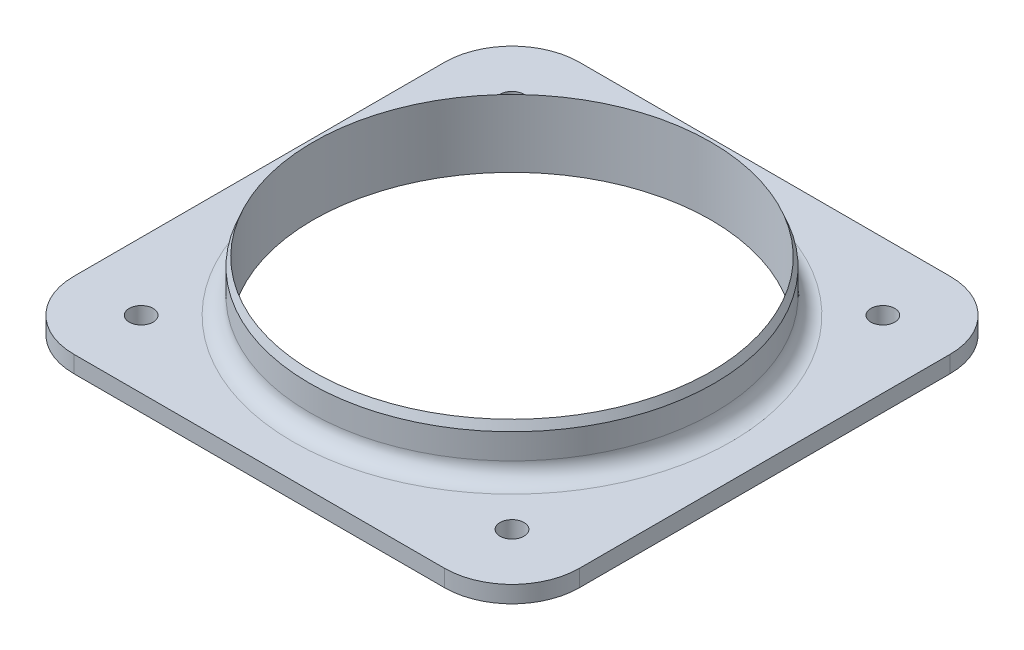
ISO-10303-21;
HEADER;
FILE_DESCRIPTION(('STEP AP214'),'2;1');
FILE_NAME('part.step','',(''),(''),'','','');
FILE_SCHEMA(('AUTOMOTIVE_DESIGN { 1 0 10303 214 1 1 1 1 }'));
ENDSEC;
DATA;
#1=APPLICATION_CONTEXT('core data for automotive mechanical design processes');
#2=APPLICATION_PROTOCOL_DEFINITION('international standard','automotive_design',2000,#1);
#3=PRODUCT_CONTEXT('',#1,'mechanical');
#4=PRODUCT('Part','Part','',(#3));
#5=PRODUCT_RELATED_PRODUCT_CATEGORY('part','',(#4));
#6=PRODUCT_DEFINITION_FORMATION('','',#4);
#7=PRODUCT_DEFINITION_CONTEXT('part definition',#1,'design');
#8=PRODUCT_DEFINITION('design','',#6,#7);
#9=PRODUCT_DEFINITION_SHAPE('','',#8);
#10=(LENGTH_UNIT() NAMED_UNIT(*) SI_UNIT(.MILLI.,.METRE.));
#11=(NAMED_UNIT(*) PLANE_ANGLE_UNIT() SI_UNIT($,.RADIAN.));
#12=(NAMED_UNIT(*) SI_UNIT($,.STERADIAN.) SOLID_ANGLE_UNIT());
#13=UNCERTAINTY_MEASURE_WITH_UNIT(LENGTH_MEASURE(1.E-05),#10,'distance_accuracy_value','');
#14=(GEOMETRIC_REPRESENTATION_CONTEXT(3) GLOBAL_UNCERTAINTY_ASSIGNED_CONTEXT((#13)) GLOBAL_UNIT_ASSIGNED_CONTEXT((#10,
#11,#12)) REPRESENTATION_CONTEXT('',''));
#15=CARTESIAN_POINT('',(0.,0.,0.));
#16=DIRECTION('',(0.,0.,1.));
#17=DIRECTION('',(1.,0.,0.));
#18=AXIS2_PLACEMENT_3D('',#15,#16,#17);
#19=CARTESIAN_POINT('',(0.,3.175,0.));
#20=DIRECTION('',(0.,1.,0.));
#21=DIRECTION('',(0.,0.,1.));
#22=AXIS2_PLACEMENT_3D('',#19,#20,#21);
#23=PLANE('',#22);
#24=CARTESIAN_POINT('',(0.,3.175,0.));
#25=DIRECTION('',(0.,1.,0.));
#26=DIRECTION('',(0.,0.,1.));
#27=AXIS2_PLACEMENT_3D('',#24,#25,#26);
#28=CIRCLE('',#27,41.275);
#29=CARTESIAN_POINT('',(0.,3.175,41.275));
#30=VERTEX_POINT('',#29);
#31=EDGE_CURVE('E11',#30,#30,#28,.F.);
#32=ORIENTED_EDGE('',*,*,#31,.T.);
#33=EDGE_LOOP('',(#32));
#34=FACE_BOUND('',#33,.T.);
#35=CARTESIAN_POINT('',(-34.9250000000004,3.175,34.9249999999996));
#36=DIRECTION('',(0.,1.,0.));
#37=DIRECTION('',(1.,0.,0.));
#38=AXIS2_PLACEMENT_3D('',#35,#36,#37);
#39=CIRCLE('',#38,2.25);
#40=CARTESIAN_POINT('',(-32.6750000000004,3.175,34.9249999999996));
#41=VERTEX_POINT('',#40);
#42=EDGE_CURVE('E255',#41,#41,#39,.T.);
#43=ORIENTED_EDGE('',*,*,#42,.F.);
#44=EDGE_LOOP('',(#43));
#45=FACE_BOUND('',#44,.T.);
#46=CARTESIAN_POINT('',(34.925,3.175,34.925));
#47=DIRECTION('',(0.,1.,0.));
#48=DIRECTION('',(0.,0.,-1.));
#49=AXIS2_PLACEMENT_3D('',#46,#47,#48);
#50=CIRCLE('',#49,2.25);
#51=CARTESIAN_POINT('',(34.925,3.175,32.675));
#52=VERTEX_POINT('',#51);
#53=EDGE_CURVE('E249',#52,#52,#50,.T.);
#54=ORIENTED_EDGE('',*,*,#53,.F.);
#55=EDGE_LOOP('',(#54));
#56=FACE_BOUND('',#55,.T.);
#57=CARTESIAN_POINT('',(34.9250000000001,3.175,-34.9249999999999));
#58=DIRECTION('',(0.,1.,0.));
#59=DIRECTION('',(-1.,0.,0.));
#60=AXIS2_PLACEMENT_3D('',#57,#58,#59);
#61=CIRCLE('',#60,2.25);
#62=CARTESIAN_POINT('',(32.6750000000001,3.175,-34.9249999999999));
#63=VERTEX_POINT('',#62);
#64=EDGE_CURVE('E243',#63,#63,#61,.T.);
#65=ORIENTED_EDGE('',*,*,#64,.F.);
#66=EDGE_LOOP('',(#65));
#67=FACE_BOUND('',#66,.T.);
#68=CARTESIAN_POINT('',(-34.925,3.175,-34.925));
#69=DIRECTION('',(0.,1.,0.));
#70=DIRECTION('',(0.,0.,1.));
#71=AXIS2_PLACEMENT_3D('',#68,#69,#70);
#72=CIRCLE('',#71,2.25);
#73=CARTESIAN_POINT('',(-34.925,3.175,-32.675));
#74=VERTEX_POINT('',#73);
#75=EDGE_CURVE('E237',#74,#74,#72,.T.);
#76=ORIENTED_EDGE('',*,*,#75,.F.);
#77=EDGE_LOOP('',(#76));
#78=FACE_BOUND('',#77,.T.);
#79=DIRECTION('',(-1.,0.,0.));
#80=VECTOR('',#79,1.);
#81=CARTESIAN_POINT('',(47.625,3.175,-47.625));
#82=LINE('',#81,#80);
#83=CARTESIAN_POINT('',(34.925,3.175,-47.625));
#84=VERTEX_POINT('',#83);
#85=CARTESIAN_POINT('',(-34.925,3.175,-47.625));
#86=VERTEX_POINT('',#85);
#87=EDGE_CURVE('E141',#84,#86,#82,.T.);
#88=ORIENTED_EDGE('',*,*,#87,.T.);
#89=CARTESIAN_POINT('',(-34.925,3.175,-34.925));
#90=DIRECTION('',(0.,1.,0.));
#91=DIRECTION('',(0.,0.,1.));
#92=AXIS2_PLACEMENT_3D('',#89,#90,#91);
#93=CIRCLE('',#92,12.7);
#94=CARTESIAN_POINT('',(-47.625,3.175,-34.925));
#95=VERTEX_POINT('',#94);
#96=EDGE_CURVE('E160',#86,#95,#93,.T.);
#97=ORIENTED_EDGE('',*,*,#96,.T.);
#98=DIRECTION('',(0.,0.,1.));
#99=VECTOR('',#98,1.);
#100=CARTESIAN_POINT('',(-47.625,3.175,47.625));
#101=LINE('',#100,#99);
#102=CARTESIAN_POINT('',(-47.625,3.175,34.925));
#103=VERTEX_POINT('',#102);
#104=EDGE_CURVE('E124',#95,#103,#101,.T.);
#105=ORIENTED_EDGE('',*,*,#104,.T.);
#106=CARTESIAN_POINT('',(-34.925,3.175,34.925));
#107=DIRECTION('',(0.,1.,0.));
#108=DIRECTION('',(0.,0.,1.));
#109=AXIS2_PLACEMENT_3D('',#106,#107,#108);
#110=CIRCLE('',#109,12.7);
#111=CARTESIAN_POINT('',(-34.925,3.175,47.625));
#112=VERTEX_POINT('',#111);
#113=EDGE_CURVE('E158',#103,#112,#110,.T.);
#114=ORIENTED_EDGE('',*,*,#113,.T.);
#115=DIRECTION('',(1.,0.,0.));
#116=VECTOR('',#115,1.);
#117=CARTESIAN_POINT('',(47.625,3.175,47.625));
#118=LINE('',#117,#116);
#119=CARTESIAN_POINT('',(34.925,3.175,47.625));
#120=VERTEX_POINT('',#119);
#121=EDGE_CURVE('E233',#112,#120,#118,.T.);
#122=ORIENTED_EDGE('',*,*,#121,.T.);
#123=CARTESIAN_POINT('',(34.925,3.175,34.925));
#124=DIRECTION('',(0.,1.,0.));
#125=DIRECTION('',(0.,0.,1.));
#126=AXIS2_PLACEMENT_3D('',#123,#124,#125);
#127=CIRCLE('',#126,12.7);
#128=CARTESIAN_POINT('',(47.625,3.175,34.925));
#129=VERTEX_POINT('',#128);
#130=EDGE_CURVE('E59',#120,#129,#127,.T.);
#131=ORIENTED_EDGE('',*,*,#130,.T.);
#132=DIRECTION('',(0.,0.,-1.));
#133=VECTOR('',#132,1.);
#134=CARTESIAN_POINT('',(47.625,3.175,47.625));
#135=LINE('',#134,#133);
#136=CARTESIAN_POINT('',(47.625,3.175,-34.925));
#137=VERTEX_POINT('',#136);
#138=EDGE_CURVE('E232',#129,#137,#135,.T.);
#139=ORIENTED_EDGE('',*,*,#138,.T.);
#140=CARTESIAN_POINT('',(34.925,3.175,-34.925));
#141=DIRECTION('',(0.,1.,0.));
#142=DIRECTION('',(0.,0.,1.));
#143=AXIS2_PLACEMENT_3D('',#140,#141,#142);
#144=CIRCLE('',#143,12.7);
#145=EDGE_CURVE('E155',#137,#84,#144,.T.);
#146=ORIENTED_EDGE('',*,*,#145,.T.);
#147=EDGE_LOOP('',(#88,#97,#105,#114,#122,#131,#139,#146));
#148=FACE_BOUND('',#147,.T.);
#149=ADVANCED_FACE('F37',(#34,#45,#56,#67,#78,#148),#23,.T.);
#150=CARTESIAN_POINT('',(0.,0.,0.));
#151=DIRECTION('',(0.,1.,0.));
#152=DIRECTION('',(0.,0.,1.));
#153=AXIS2_PLACEMENT_3D('',#150,#151,#152);
#154=PLANE('',#153);
#155=CARTESIAN_POINT('',(-34.9250000000004,0.,34.9249999999996));
#156=DIRECTION('',(0.,1.,0.));
#157=DIRECTION('',(1.,0.,0.));
#158=AXIS2_PLACEMENT_3D('',#155,#156,#157);
#159=CIRCLE('',#158,2.25);
#160=CARTESIAN_POINT('',(-32.6750000000004,0.,34.9249999999996));
#161=VERTEX_POINT('',#160);
#162=EDGE_CURVE('E252',#161,#161,#159,.T.);
#163=ORIENTED_EDGE('',*,*,#162,.T.);
#164=EDGE_LOOP('',(#163));
#165=FACE_BOUND('',#164,.T.);
#166=CARTESIAN_POINT('',(34.925,0.,34.925));
#167=DIRECTION('',(0.,1.,0.));
#168=DIRECTION('',(0.,0.,-1.));
#169=AXIS2_PLACEMENT_3D('',#166,#167,#168);
#170=CIRCLE('',#169,2.25);
#171=CARTESIAN_POINT('',(34.925,0.,32.675));
#172=VERTEX_POINT('',#171);
#173=EDGE_CURVE('E246',#172,#172,#170,.T.);
#174=ORIENTED_EDGE('',*,*,#173,.T.);
#175=EDGE_LOOP('',(#174));
#176=FACE_BOUND('',#175,.T.);
#177=CARTESIAN_POINT('',(34.9250000000001,0.,-34.9249999999999));
#178=DIRECTION('',(0.,1.,0.));
#179=DIRECTION('',(-1.,0.,0.));
#180=AXIS2_PLACEMENT_3D('',#177,#178,#179);
#181=CIRCLE('',#180,2.25);
#182=CARTESIAN_POINT('',(32.6750000000001,0.,-34.9249999999999));
#183=VERTEX_POINT('',#182);
#184=EDGE_CURVE('E240',#183,#183,#181,.T.);
#185=ORIENTED_EDGE('',*,*,#184,.T.);
#186=EDGE_LOOP('',(#185));
#187=FACE_BOUND('',#186,.T.);
#188=CARTESIAN_POINT('',(-34.925,0.,-34.925));
#189=DIRECTION('',(0.,1.,0.));
#190=DIRECTION('',(0.,0.,1.));
#191=AXIS2_PLACEMENT_3D('',#188,#189,#190);
#192=CIRCLE('',#191,2.25);
#193=CARTESIAN_POINT('',(-34.925,0.,-32.675));
#194=VERTEX_POINT('',#193);
#195=EDGE_CURVE('E138',#194,#194,#192,.T.);
#196=ORIENTED_EDGE('',*,*,#195,.T.);
#197=EDGE_LOOP('',(#196));
#198=FACE_BOUND('',#197,.T.);
#199=DIRECTION('',(0.,0.,1.));
#200=VECTOR('',#199,1.);
#201=CARTESIAN_POINT('',(-47.625,0.,47.625));
#202=LINE('',#201,#200);
#203=CARTESIAN_POINT('',(-47.625,0.,-34.925));
#204=VERTEX_POINT('',#203);
#205=CARTESIAN_POINT('',(-47.625,0.,34.925));
#206=VERTEX_POINT('',#205);
#207=EDGE_CURVE('E121',#204,#206,#202,.T.);
#208=ORIENTED_EDGE('',*,*,#207,.F.);
#209=CARTESIAN_POINT('',(-34.925,0.,-34.925));
#210=DIRECTION('',(0.,1.,0.));
#211=DIRECTION('',(0.,0.,1.));
#212=AXIS2_PLACEMENT_3D('',#209,#210,#211);
#213=CIRCLE('',#212,12.7);
#214=CARTESIAN_POINT('',(-34.925,0.,-47.625));
#215=VERTEX_POINT('',#214);
#216=EDGE_CURVE('E104',#204,#215,#213,.F.);
#217=ORIENTED_EDGE('',*,*,#216,.T.);
#218=DIRECTION('',(-1.,0.,0.));
#219=VECTOR('',#218,1.);
#220=CARTESIAN_POINT('',(47.625,0.,-47.625));
#221=LINE('',#220,#219);
#222=CARTESIAN_POINT('',(34.925,0.,-47.625));
#223=VERTEX_POINT('',#222);
#224=EDGE_CURVE('E145',#223,#215,#221,.T.);
#225=ORIENTED_EDGE('',*,*,#224,.F.);
#226=CARTESIAN_POINT('',(34.925,0.,-34.925));
#227=DIRECTION('',(0.,1.,0.));
#228=DIRECTION('',(0.,0.,1.));
#229=AXIS2_PLACEMENT_3D('',#226,#227,#228);
#230=CIRCLE('',#229,12.7);
#231=CARTESIAN_POINT('',(47.625,0.,-34.925));
#232=VERTEX_POINT('',#231);
#233=EDGE_CURVE('E125',#223,#232,#230,.F.);
#234=ORIENTED_EDGE('',*,*,#233,.T.);
#235=DIRECTION('',(0.,0.,-1.));
#236=VECTOR('',#235,1.);
#237=CARTESIAN_POINT('',(47.625,0.,47.625));
#238=LINE('',#237,#236);
#239=CARTESIAN_POINT('',(47.625,0.,34.925));
#240=VERTEX_POINT('',#239);
#241=EDGE_CURVE('E135',#240,#232,#238,.T.);
#242=ORIENTED_EDGE('',*,*,#241,.F.);
#243=CARTESIAN_POINT('',(34.925,0.,34.925));
#244=DIRECTION('',(0.,1.,0.));
#245=DIRECTION('',(0.,0.,1.));
#246=AXIS2_PLACEMENT_3D('',#243,#244,#245);
#247=CIRCLE('',#246,12.7);
#248=CARTESIAN_POINT('',(34.925,0.,47.625));
#249=VERTEX_POINT('',#248);
#250=EDGE_CURVE('E149',#240,#249,#247,.F.);
#251=ORIENTED_EDGE('',*,*,#250,.T.);
#252=DIRECTION('',(1.,0.,0.));
#253=VECTOR('',#252,1.);
#254=CARTESIAN_POINT('',(47.625,0.,47.625));
#255=LINE('',#254,#253);
#256=CARTESIAN_POINT('',(-34.925,0.,47.625));
#257=VERTEX_POINT('',#256);
#258=EDGE_CURVE('E131',#257,#249,#255,.T.);
#259=ORIENTED_EDGE('',*,*,#258,.F.);
#260=CARTESIAN_POINT('',(-34.925,0.,34.925));
#261=DIRECTION('',(0.,1.,0.));
#262=DIRECTION('',(0.,0.,1.));
#263=AXIS2_PLACEMENT_3D('',#260,#261,#262);
#264=CIRCLE('',#263,12.7);
#265=EDGE_CURVE('E115',#257,#206,#264,.F.);
#266=ORIENTED_EDGE('',*,*,#265,.T.);
#267=EDGE_LOOP('',(#208,#217,#225,#234,#242,#251,#259,#266));
#268=FACE_BOUND('',#267,.T.);
#269=CARTESIAN_POINT('',(0.,0.,0.));
#270=DIRECTION('',(0.,1.,0.));
#271=DIRECTION('',(0.,0.,1.));
#272=AXIS2_PLACEMENT_3D('',#269,#270,#271);
#273=CIRCLE('',#272,37.465);
#274=CARTESIAN_POINT('',(0.,0.,37.465));
#275=VERTEX_POINT('',#274);
#276=EDGE_CURVE('E132',#275,#275,#273,.T.);
#277=ORIENTED_EDGE('',*,*,#276,.T.);
#278=EDGE_LOOP('',(#277));
#279=FACE_BOUND('',#278,.T.);
#280=ADVANCED_FACE('F128',(#165,#176,#187,#198,#268,#279),#154,.F.);
#281=CARTESIAN_POINT('',(-47.625,3.175,47.625));
#282=DIRECTION('',(1.,0.,0.));
#283=DIRECTION('',(0.,0.,-1.));
#284=AXIS2_PLACEMENT_3D('',#281,#282,#283);
#285=PLANE('',#284);
#286=ORIENTED_EDGE('',*,*,#104,.F.);
#287=DIRECTION('',(0.,-1.,0.));
#288=VECTOR('',#287,1.);
#289=CARTESIAN_POINT('',(-47.625,3.175,-34.925));
#290=LINE('',#289,#288);
#291=EDGE_CURVE('E108',#95,#204,#290,.T.);
#292=ORIENTED_EDGE('',*,*,#291,.T.);
#293=ORIENTED_EDGE('',*,*,#207,.T.);
#294=DIRECTION('',(0.,-1.,0.));
#295=VECTOR('',#294,1.);
#296=CARTESIAN_POINT('',(-47.625,3.175,34.925));
#297=LINE('',#296,#295);
#298=EDGE_CURVE('E126',#206,#103,#297,.F.);
#299=ORIENTED_EDGE('',*,*,#298,.T.);
#300=EDGE_LOOP('',(#286,#292,#293,#299));
#301=FACE_BOUND('',#300,.T.);
#302=ADVANCED_FACE('F120',(#301),#285,.F.);
#303=CARTESIAN_POINT('',(47.625,3.175,47.625));
#304=DIRECTION('',(0.,0.,-1.));
#305=DIRECTION('',(-1.,0.,0.));
#306=AXIS2_PLACEMENT_3D('',#303,#304,#305);
#307=PLANE('',#306);
#308=ORIENTED_EDGE('',*,*,#121,.F.);
#309=DIRECTION('',(0.,-1.,0.));
#310=VECTOR('',#309,1.);
#311=CARTESIAN_POINT('',(-34.925,3.175,47.625));
#312=LINE('',#311,#310);
#313=EDGE_CURVE('E164',#112,#257,#312,.T.);
#314=ORIENTED_EDGE('',*,*,#313,.T.);
#315=ORIENTED_EDGE('',*,*,#258,.T.);
#316=DIRECTION('',(0.,-1.,0.));
#317=VECTOR('',#316,1.);
#318=CARTESIAN_POINT('',(34.925,3.175,47.625));
#319=LINE('',#318,#317);
#320=EDGE_CURVE('E162',#249,#120,#319,.F.);
#321=ORIENTED_EDGE('',*,*,#320,.T.);
#322=EDGE_LOOP('',(#308,#314,#315,#321));
#323=FACE_BOUND('',#322,.T.);
#324=ADVANCED_FACE('F205',(#323),#307,.F.);
#325=CARTESIAN_POINT('',(47.625,3.175,47.625));
#326=DIRECTION('',(-1.,0.,0.));
#327=DIRECTION('',(0.,0.,1.));
#328=AXIS2_PLACEMENT_3D('',#325,#326,#327);
#329=PLANE('',#328);
#330=ORIENTED_EDGE('',*,*,#138,.F.);
#331=DIRECTION('',(0.,-1.,0.));
#332=VECTOR('',#331,1.);
#333=CARTESIAN_POINT('',(47.625,3.175,34.925));
#334=LINE('',#333,#332);
#335=EDGE_CURVE('E168',#129,#240,#334,.T.);
#336=ORIENTED_EDGE('',*,*,#335,.T.);
#337=ORIENTED_EDGE('',*,*,#241,.T.);
#338=DIRECTION('',(0.,-1.,0.));
#339=VECTOR('',#338,1.);
#340=CARTESIAN_POINT('',(47.625,3.175,-34.925));
#341=LINE('',#340,#339);
#342=EDGE_CURVE('E52',#232,#137,#341,.F.);
#343=ORIENTED_EDGE('',*,*,#342,.T.);
#344=EDGE_LOOP('',(#330,#336,#337,#343));
#345=FACE_BOUND('',#344,.T.);
#346=ADVANCED_FACE('F201',(#345),#329,.F.);
#347=CARTESIAN_POINT('',(47.625,3.175,-47.625));
#348=DIRECTION('',(0.,0.,1.));
#349=DIRECTION('',(1.,0.,0.));
#350=AXIS2_PLACEMENT_3D('',#347,#348,#349);
#351=PLANE('',#350);
#352=ORIENTED_EDGE('',*,*,#224,.T.);
#353=DIRECTION('',(0.,-1.,0.));
#354=VECTOR('',#353,1.);
#355=CARTESIAN_POINT('',(-34.925,3.175,-47.625));
#356=LINE('',#355,#354);
#357=EDGE_CURVE('E109',#215,#86,#356,.F.);
#358=ORIENTED_EDGE('',*,*,#357,.T.);
#359=ORIENTED_EDGE('',*,*,#87,.F.);
#360=DIRECTION('',(0.,-1.,0.));
#361=VECTOR('',#360,1.);
#362=CARTESIAN_POINT('',(34.925,3.175,-47.625));
#363=LINE('',#362,#361);
#364=EDGE_CURVE('E114',#84,#223,#363,.T.);
#365=ORIENTED_EDGE('',*,*,#364,.T.);
#366=EDGE_LOOP('',(#352,#358,#359,#365));
#367=FACE_BOUND('',#366,.T.);
#368=ADVANCED_FACE('F198',(#367),#351,.F.);
#369=CARTESIAN_POINT('',(0.,3.175,0.));
#370=DIRECTION('',(0.,-1.,0.));
#371=DIRECTION('',(0.,0.,-1.));
#372=AXIS2_PLACEMENT_3D('',#369,#370,#371);
#373=CYLINDRICAL_SURFACE('',#372,37.465);
#374=ORIENTED_EDGE('',*,*,#276,.F.);
#375=EDGE_LOOP('',(#374));
#376=FACE_BOUND('',#375,.T.);
#377=CARTESIAN_POINT('',(0.,12.7,0.));
#378=DIRECTION('',(0.,-1.,0.));
#379=DIRECTION('',(0.,0.,-1.));
#380=AXIS2_PLACEMENT_3D('',#377,#378,#379);
#381=CIRCLE('',#380,37.465);
#382=CARTESIAN_POINT('',(0.,12.7,-37.465));
#383=VERTEX_POINT('',#382);
#384=EDGE_CURVE('E263',#383,#383,#381,.T.);
#385=ORIENTED_EDGE('',*,*,#384,.F.);
#386=EDGE_LOOP('',(#385));
#387=FACE_BOUND('',#386,.T.);
#388=ADVANCED_FACE('F195',(#376,#387),#373,.F.);
#389=CARTESIAN_POINT('',(-34.925,0.,-34.925));
#390=DIRECTION('',(0.,1.,0.));
#391=DIRECTION('',(0.,0.,1.));
#392=AXIS2_PLACEMENT_3D('',#389,#390,#391);
#393=CYLINDRICAL_SURFACE('',#392,2.25);
#394=ORIENTED_EDGE('',*,*,#195,.F.);
#395=EDGE_LOOP('',(#394));
#396=FACE_BOUND('',#395,.T.);
#397=ORIENTED_EDGE('',*,*,#75,.T.);
#398=EDGE_LOOP('',(#397));
#399=FACE_BOUND('',#398,.T.);
#400=ADVANCED_FACE('F269',(#396,#399),#393,.F.);
#401=CARTESIAN_POINT('',(34.9250000000001,0.,-34.9249999999999));
#402=DIRECTION('',(0.,1.,0.));
#403=DIRECTION('',(0.,0.,1.));
#404=AXIS2_PLACEMENT_3D('',#401,#402,#403);
#405=CYLINDRICAL_SURFACE('',#404,2.25);
#406=ORIENTED_EDGE('',*,*,#184,.F.);
#407=EDGE_LOOP('',(#406));
#408=FACE_BOUND('',#407,.T.);
#409=ORIENTED_EDGE('',*,*,#64,.T.);
#410=EDGE_LOOP('',(#409));
#411=FACE_BOUND('',#410,.T.);
#412=ADVANCED_FACE('F274',(#408,#411),#405,.F.);
#413=CARTESIAN_POINT('',(34.925,0.,34.925));
#414=DIRECTION('',(0.,1.,0.));
#415=DIRECTION('',(0.,0.,1.));
#416=AXIS2_PLACEMENT_3D('',#413,#414,#415);
#417=CYLINDRICAL_SURFACE('',#416,2.25);
#418=ORIENTED_EDGE('',*,*,#173,.F.);
#419=EDGE_LOOP('',(#418));
#420=FACE_BOUND('',#419,.T.);
#421=ORIENTED_EDGE('',*,*,#53,.T.);
#422=EDGE_LOOP('',(#421));
#423=FACE_BOUND('',#422,.T.);
#424=ADVANCED_FACE('F280',(#420,#423),#417,.F.);
#425=CARTESIAN_POINT('',(-34.9250000000004,0.,34.9249999999996));
#426=DIRECTION('',(0.,1.,0.));
#427=DIRECTION('',(0.,0.,1.));
#428=AXIS2_PLACEMENT_3D('',#425,#426,#427);
#429=CYLINDRICAL_SURFACE('',#428,2.25);
#430=ORIENTED_EDGE('',*,*,#162,.F.);
#431=EDGE_LOOP('',(#430));
#432=FACE_BOUND('',#431,.T.);
#433=ORIENTED_EDGE('',*,*,#42,.T.);
#434=EDGE_LOOP('',(#433));
#435=FACE_BOUND('',#434,.T.);
#436=ADVANCED_FACE('F214',(#432,#435),#429,.F.);
#437=CARTESIAN_POINT('',(-34.925,3.175,-34.925));
#438=DIRECTION('',(0.,-1.,0.));
#439=DIRECTION('',(0.,0.,-1.));
#440=AXIS2_PLACEMENT_3D('',#437,#438,#439);
#441=CYLINDRICAL_SURFACE('',#440,12.7);
#442=ORIENTED_EDGE('',*,*,#96,.F.);
#443=ORIENTED_EDGE('',*,*,#357,.F.);
#444=ORIENTED_EDGE('',*,*,#216,.F.);
#445=ORIENTED_EDGE('',*,*,#291,.F.);
#446=EDGE_LOOP('',(#442,#443,#444,#445));
#447=FACE_BOUND('',#446,.T.);
#448=ADVANCED_FACE('F107',(#447),#441,.T.);
#449=CARTESIAN_POINT('',(-34.925,3.175,34.925));
#450=DIRECTION('',(0.,-1.,0.));
#451=DIRECTION('',(0.,0.,-1.));
#452=AXIS2_PLACEMENT_3D('',#449,#450,#451);
#453=CYLINDRICAL_SURFACE('',#452,12.7);
#454=ORIENTED_EDGE('',*,*,#113,.F.);
#455=ORIENTED_EDGE('',*,*,#298,.F.);
#456=ORIENTED_EDGE('',*,*,#265,.F.);
#457=ORIENTED_EDGE('',*,*,#313,.F.);
#458=EDGE_LOOP('',(#454,#455,#456,#457));
#459=FACE_BOUND('',#458,.T.);
#460=ADVANCED_FACE('F213',(#459),#453,.T.);
#461=CARTESIAN_POINT('',(34.925,3.175,34.925));
#462=DIRECTION('',(0.,-1.,0.));
#463=DIRECTION('',(0.,0.,-1.));
#464=AXIS2_PLACEMENT_3D('',#461,#462,#463);
#465=CYLINDRICAL_SURFACE('',#464,12.7);
#466=ORIENTED_EDGE('',*,*,#130,.F.);
#467=ORIENTED_EDGE('',*,*,#320,.F.);
#468=ORIENTED_EDGE('',*,*,#250,.F.);
#469=ORIENTED_EDGE('',*,*,#335,.F.);
#470=EDGE_LOOP('',(#466,#467,#468,#469));
#471=FACE_BOUND('',#470,.T.);
#472=ADVANCED_FACE('F217',(#471),#465,.T.);
#473=CARTESIAN_POINT('',(34.925,3.175,-34.925));
#474=DIRECTION('',(0.,-1.,0.));
#475=DIRECTION('',(0.,0.,-1.));
#476=AXIS2_PLACEMENT_3D('',#473,#474,#475);
#477=CYLINDRICAL_SURFACE('',#476,12.7);
#478=ORIENTED_EDGE('',*,*,#145,.F.);
#479=ORIENTED_EDGE('',*,*,#342,.F.);
#480=ORIENTED_EDGE('',*,*,#233,.F.);
#481=ORIENTED_EDGE('',*,*,#364,.F.);
#482=EDGE_LOOP('',(#478,#479,#480,#481));
#483=FACE_BOUND('',#482,.T.);
#484=ADVANCED_FACE('F220',(#483),#477,.T.);
#485=CARTESIAN_POINT('',(0.,0.,0.));
#486=DIRECTION('',(0.,-1.,0.));
#487=DIRECTION('',(0.,0.,-1.));
#488=AXIS2_PLACEMENT_3D('',#485,#486,#487);
#489=CYLINDRICAL_SURFACE('',#488,38.1);
#490=CARTESIAN_POINT('',(0.,6.35,0.));
#491=DIRECTION('',(0.,1.,0.));
#492=DIRECTION('',(0.,0.,1.));
#493=AXIS2_PLACEMENT_3D('',#490,#491,#492);
#494=CIRCLE('',#493,38.1);
#495=CARTESIAN_POINT('',(0.,6.35,38.1));
#496=VERTEX_POINT('',#495);
#497=EDGE_CURVE('E45',#496,#496,#494,.T.);
#498=ORIENTED_EDGE('',*,*,#497,.T.);
#499=EDGE_LOOP('',(#498));
#500=FACE_BOUND('',#499,.T.);
#501=CARTESIAN_POINT('',(0.,11.1125,0.));
#502=DIRECTION('',(0.,-1.,0.));
#503=DIRECTION('',(0.,0.,-1.));
#504=AXIS2_PLACEMENT_3D('',#501,#502,#503);
#505=CIRCLE('',#504,38.1);
#506=CARTESIAN_POINT('',(0.,11.1125,-38.1));
#507=VERTEX_POINT('',#506);
#508=EDGE_CURVE('E258',#507,#507,#505,.T.);
#509=ORIENTED_EDGE('',*,*,#508,.T.);
#510=EDGE_LOOP('',(#509));
#511=FACE_BOUND('',#510,.T.);
#512=ADVANCED_FACE('F173',(#500,#511),#489,.T.);
#513=CARTESIAN_POINT('',(0.,12.7,0.));
#514=DIRECTION('',(0.,-1.,0.));
#515=DIRECTION('',(0.,0.,-1.));
#516=AXIS2_PLACEMENT_3D('',#513,#514,#515);
#517=CONICAL_SURFACE('',#516,37.465,0.380506377112359);
#518=ORIENTED_EDGE('',*,*,#508,.F.);
#519=EDGE_LOOP('',(#518));
#520=FACE_BOUND('',#519,.T.);
#521=ORIENTED_EDGE('',*,*,#384,.T.);
#522=EDGE_LOOP('',(#521));
#523=FACE_BOUND('',#522,.T.);
#524=ADVANCED_FACE('F177',(#520,#523),#517,.T.);
#525=CARTESIAN_POINT('',(0.,6.35,0.));
#526=DIRECTION('',(0.,1.,0.));
#527=DIRECTION('',(0.,0.,1.));
#528=AXIS2_PLACEMENT_3D('',#525,#526,#527);
#529=TOROIDAL_SURFACE('',#528,41.275,3.175);
#530=ORIENTED_EDGE('',*,*,#31,.F.);
#531=EDGE_LOOP('',(#530));
#532=FACE_BOUND('',#531,.T.);
#533=ORIENTED_EDGE('',*,*,#497,.F.);
#534=EDGE_LOOP('',(#533));
#535=FACE_BOUND('',#534,.T.);
#536=ADVANCED_FACE('F39',(#532,#535),#529,.F.);
#537=CLOSED_SHELL('',(#149,#280,#302,#324,#346,#368,#388,#400,#412,#424,#436,#448,#460,#472,
#484,#512,#524,#536));
#538=MANIFOLD_SOLID_BREP('B2',#537);
#539=ADVANCED_BREP_SHAPE_REPRESENTATION('',(#18,#538),#14);
#540=SHAPE_DEFINITION_REPRESENTATION(#9,#539);
ENDSEC;
END-ISO-10303-21;
